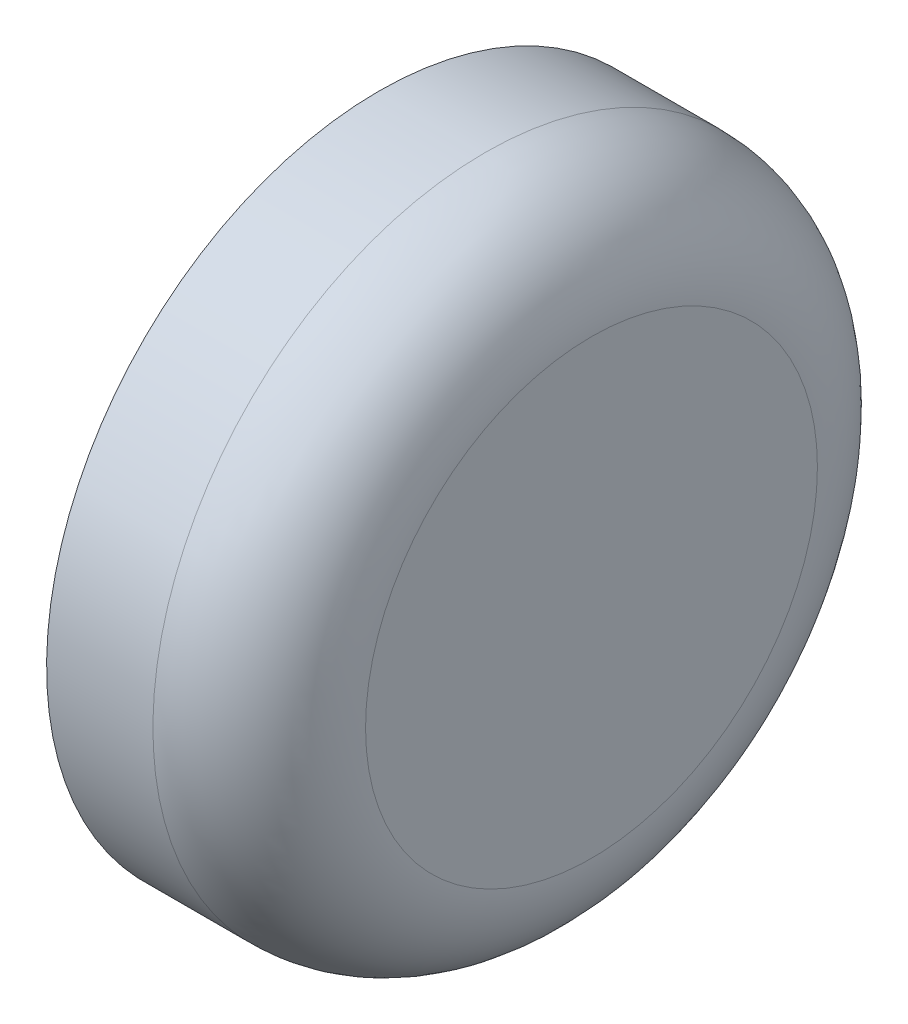
ISO-10303-21;
HEADER;
FILE_DESCRIPTION(('STEP AP214'),'2;1');
FILE_NAME('part.step','',(''),(''),'','','');
FILE_SCHEMA(('AUTOMOTIVE_DESIGN { 1 0 10303 214 1 1 1 1 }'));
ENDSEC;
DATA;
#1=APPLICATION_CONTEXT('core data for automotive mechanical design processes');
#2=APPLICATION_PROTOCOL_DEFINITION('international standard','automotive_design',2000,#1);
#3=PRODUCT_CONTEXT('',#1,'mechanical');
#4=PRODUCT('Part','Part','',(#3));
#5=PRODUCT_RELATED_PRODUCT_CATEGORY('part','',(#4));
#6=PRODUCT_DEFINITION_FORMATION('','',#4);
#7=PRODUCT_DEFINITION_CONTEXT('part definition',#1,'design');
#8=PRODUCT_DEFINITION('design','',#6,#7);
#9=PRODUCT_DEFINITION_SHAPE('','',#8);
#10=(LENGTH_UNIT() NAMED_UNIT(*) SI_UNIT(.MILLI.,.METRE.));
#11=(NAMED_UNIT(*) PLANE_ANGLE_UNIT() SI_UNIT($,.RADIAN.));
#12=(NAMED_UNIT(*) SI_UNIT($,.STERADIAN.) SOLID_ANGLE_UNIT());
#13=UNCERTAINTY_MEASURE_WITH_UNIT(LENGTH_MEASURE(1.E-05),#10,'distance_accuracy_value','');
#14=(GEOMETRIC_REPRESENTATION_CONTEXT(3) GLOBAL_UNCERTAINTY_ASSIGNED_CONTEXT((#13)) GLOBAL_UNIT_ASSIGNED_CONTEXT((#10,
#11,#12)) REPRESENTATION_CONTEXT('',''));
#15=CARTESIAN_POINT('',(0.,0.,0.));
#16=DIRECTION('',(0.,0.,1.));
#17=DIRECTION('',(1.,0.,0.));
#18=AXIS2_PLACEMENT_3D('',#15,#16,#17);
#19=CARTESIAN_POINT('',(1.07963571469062,-0.332340218761648,0.1012));
#20=DIRECTION('',(1.,0.,0.));
#21=DIRECTION('',(0.,1.,0.));
#22=AXIS2_PLACEMENT_3D('',#19,#20,#21);
#23=PLANE('',#22);
#24=CARTESIAN_POINT('',(1.07963571469062,-0.332340218761648,0.1012));
#25=DIRECTION('',(-1.,0.,0.));
#26=DIRECTION('',(0.,0.,1.));
#27=AXIS2_PLACEMENT_3D('',#24,#25,#26);
#28=CIRCLE('',#27,0.02125);
#29=CARTESIAN_POINT('',(1.07963571469062,-0.332340218761648,0.12245));
#30=VERTEX_POINT('',#29);
#31=CARTESIAN_POINT('',(1.07963571469062,-0.311090218761648,0.1012));
#32=VERTEX_POINT('',#31);
#33=EDGE_CURVE('E41',#30,#32,#28,.T.);
#34=ORIENTED_EDGE('',*,*,#33,.F.);
#35=CARTESIAN_POINT('',(1.07963571469062,-0.332340218761648,0.1012));
#36=DIRECTION('',(-1.,0.,0.));
#37=DIRECTION('',(0.,0.,-1.));
#38=AXIS2_PLACEMENT_3D('',#35,#36,#37);
#39=CIRCLE('',#38,0.0212499999999999);
#40=CARTESIAN_POINT('',(1.07963571469062,-0.332340218761648,0.07995));
#41=VERTEX_POINT('',#40);
#42=EDGE_CURVE('E43',#41,#30,#39,.T.);
#43=ORIENTED_EDGE('',*,*,#42,.F.);
#44=CARTESIAN_POINT('',(1.07963571469062,-0.332340218761648,0.1012));
#45=DIRECTION('',(-1.,0.,0.));
#46=DIRECTION('',(0.,1.,0.));
#47=AXIS2_PLACEMENT_3D('',#44,#45,#46);
#48=CIRCLE('',#47,0.02125);
#49=EDGE_CURVE('E35',#32,#41,#48,.T.);
#50=ORIENTED_EDGE('',*,*,#49,.F.);
#51=EDGE_LOOP('',(#34,#43,#50));
#52=FACE_BOUND('',#51,.T.);
#53=ADVANCED_FACE('F17',(#52),#23,.T.);
#54=CARTESIAN_POINT('',(1.06963571469062,-0.332340218761648,0.1012));
#55=DIRECTION('',(1.,0.,0.));
#56=DIRECTION('',(0.,0.,1.));
#57=AXIS2_PLACEMENT_3D('',#54,#55,#56);
#58=TOROIDAL_SURFACE('',#57,0.02125,0.01);
#59=ORIENTED_EDGE('',*,*,#42,.T.);
#60=ORIENTED_EDGE('',*,*,#33,.T.);
#61=ORIENTED_EDGE('',*,*,#49,.T.);
#62=EDGE_LOOP('',(#59,#60,#61));
#63=FACE_BOUND('',#62,.T.);
#64=CARTESIAN_POINT('',(1.06963571469062,-0.332340218761648,0.1012));
#65=DIRECTION('',(1.,0.,0.));
#66=DIRECTION('',(0.,1.,0.));
#67=AXIS2_PLACEMENT_3D('',#64,#65,#66);
#68=CIRCLE('',#67,0.03125);
#69=CARTESIAN_POINT('',(1.06963571469062,-0.301090218761648,0.1012));
#70=VERTEX_POINT('',#69);
#71=EDGE_CURVE('E27',#70,#70,#68,.F.);
#72=ORIENTED_EDGE('',*,*,#71,.F.);
#73=EDGE_LOOP('',(#72));
#74=FACE_BOUND('',#73,.T.);
#75=ADVANCED_FACE('F44',(#63,#74),#58,.T.);
#76=CARTESIAN_POINT('',(1.07963571469062,-0.332340218761648,0.1012));
#77=DIRECTION('',(1.,0.,0.));
#78=DIRECTION('',(0.,1.,0.));
#79=AXIS2_PLACEMENT_3D('',#76,#77,#78);
#80=CYLINDRICAL_SURFACE('',#79,0.03125);
#81=CARTESIAN_POINT('',(1.05963571469062,-0.332340218761648,0.1012));
#82=DIRECTION('',(1.,0.,0.));
#83=DIRECTION('',(0.,1.,0.));
#84=AXIS2_PLACEMENT_3D('',#81,#82,#83);
#85=CIRCLE('',#84,0.03125);
#86=CARTESIAN_POINT('',(1.05963571469062,-0.301090218761648,0.1012));
#87=VERTEX_POINT('',#86);
#88=EDGE_CURVE('E11',#87,#87,#85,.T.);
#89=ORIENTED_EDGE('',*,*,#88,.T.);
#90=EDGE_LOOP('',(#89));
#91=FACE_BOUND('',#90,.T.);
#92=ORIENTED_EDGE('',*,*,#71,.T.);
#93=EDGE_LOOP('',(#92));
#94=FACE_BOUND('',#93,.T.);
#95=ADVANCED_FACE('F82',(#91,#94),#80,.T.);
#96=CARTESIAN_POINT('',(1.05963571469062,-0.332340218761648,0.1012));
#97=DIRECTION('',(1.,0.,0.));
#98=DIRECTION('',(0.,1.,0.));
#99=AXIS2_PLACEMENT_3D('',#96,#97,#98);
#100=PLANE('',#99);
#101=ORIENTED_EDGE('',*,*,#88,.F.);
#102=EDGE_LOOP('',(#101));
#103=FACE_BOUND('',#102,.T.);
#104=ADVANCED_FACE('F92',(#103),#100,.F.);
#105=CLOSED_SHELL('',(#53,#75,#95,#104));
#106=MANIFOLD_SOLID_BREP('B1',#105);
#107=ADVANCED_BREP_SHAPE_REPRESENTATION('',(#18,#106),#14);
#108=SHAPE_DEFINITION_REPRESENTATION(#9,#107);
ENDSEC;
END-ISO-10303-21;
